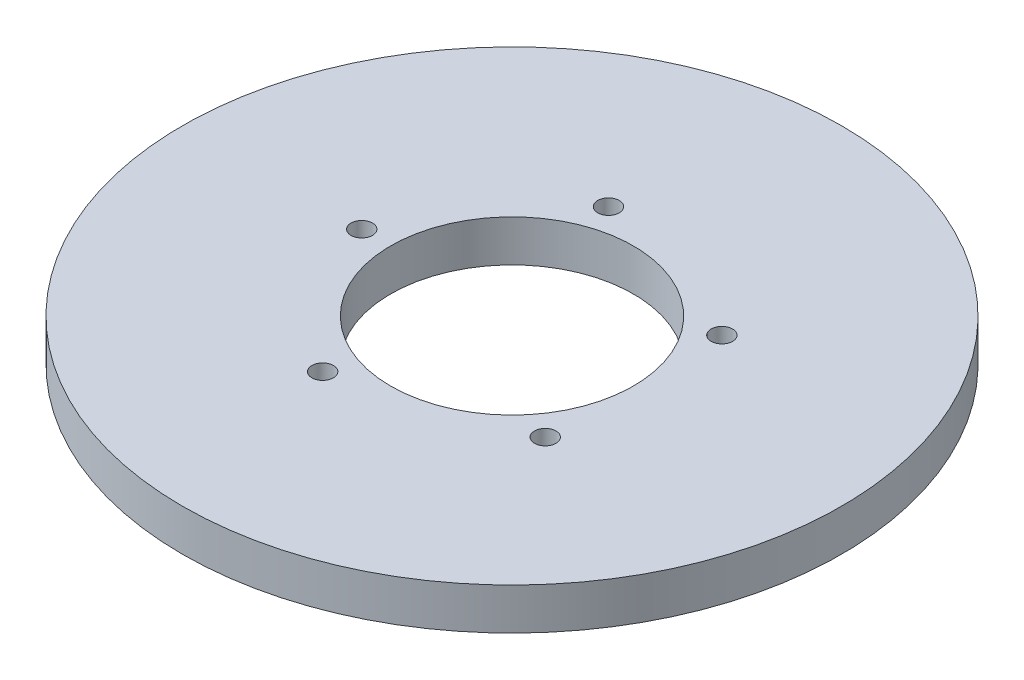
ISO-10303-21;
HEADER;
FILE_DESCRIPTION(('STEP AP214'),'2;1');
FILE_NAME('part.step','',(''),(''),'','','');
FILE_SCHEMA(('AUTOMOTIVE_DESIGN { 1 0 10303 214 1 1 1 1 }'));
ENDSEC;
DATA;
#1=APPLICATION_CONTEXT('core data for automotive mechanical design processes');
#2=APPLICATION_PROTOCOL_DEFINITION('international standard','automotive_design',2000,#1);
#3=PRODUCT_CONTEXT('',#1,'mechanical');
#4=PRODUCT('Part','Part','',(#3));
#5=PRODUCT_RELATED_PRODUCT_CATEGORY('part','',(#4));
#6=PRODUCT_DEFINITION_FORMATION('','',#4);
#7=PRODUCT_DEFINITION_CONTEXT('part definition',#1,'design');
#8=PRODUCT_DEFINITION('design','',#6,#7);
#9=PRODUCT_DEFINITION_SHAPE('','',#8);
#10=(LENGTH_UNIT() NAMED_UNIT(*) SI_UNIT(.MILLI.,.METRE.));
#11=(NAMED_UNIT(*) PLANE_ANGLE_UNIT() SI_UNIT($,.RADIAN.));
#12=(NAMED_UNIT(*) SI_UNIT($,.STERADIAN.) SOLID_ANGLE_UNIT());
#13=UNCERTAINTY_MEASURE_WITH_UNIT(LENGTH_MEASURE(1.E-05),#10,'distance_accuracy_value','');
#14=(GEOMETRIC_REPRESENTATION_CONTEXT(3) GLOBAL_UNCERTAINTY_ASSIGNED_CONTEXT((#13)) GLOBAL_UNIT_ASSIGNED_CONTEXT((#10,
#11,#12)) REPRESENTATION_CONTEXT('',''));
#15=CARTESIAN_POINT('',(0.,0.,0.));
#16=DIRECTION('',(0.,0.,1.));
#17=DIRECTION('',(1.,0.,0.));
#18=AXIS2_PLACEMENT_3D('',#15,#16,#17);
#19=CARTESIAN_POINT('',(0.,12.,0.));
#20=DIRECTION('',(0.,-1.,0.));
#21=DIRECTION('',(0.,0.,-1.));
#22=AXIS2_PLACEMENT_3D('',#19,#20,#21);
#23=CYLINDRICAL_SURFACE('',#22,95.);
#24=CARTESIAN_POINT('',(0.,12.,0.));
#25=DIRECTION('',(0.,1.,0.));
#26=DIRECTION('',(0.,0.,1.));
#27=AXIS2_PLACEMENT_3D('',#24,#25,#26);
#28=CIRCLE('',#27,95.);
#29=CARTESIAN_POINT('',(0.,12.,95.));
#30=VERTEX_POINT('',#29);
#31=EDGE_CURVE('E10',#30,#30,#28,.T.);
#32=ORIENTED_EDGE('',*,*,#31,.F.);
#33=EDGE_LOOP('',(#32));
#34=FACE_BOUND('',#33,.T.);
#35=CARTESIAN_POINT('',(0.,0.,0.));
#36=DIRECTION('',(0.,1.,0.));
#37=DIRECTION('',(0.,0.,1.));
#38=AXIS2_PLACEMENT_3D('',#35,#36,#37);
#39=CIRCLE('',#38,95.);
#40=CARTESIAN_POINT('',(0.,0.,95.));
#41=VERTEX_POINT('',#40);
#42=EDGE_CURVE('E37',#41,#41,#39,.T.);
#43=ORIENTED_EDGE('',*,*,#42,.T.);
#44=EDGE_LOOP('',(#43));
#45=FACE_BOUND('',#44,.T.);
#46=ADVANCED_FACE('F40',(#34,#45),#23,.T.);
#47=CARTESIAN_POINT('',(0.,12.,0.));
#48=DIRECTION('',(0.,1.,0.));
#49=DIRECTION('',(0.,0.,1.));
#50=AXIS2_PLACEMENT_3D('',#47,#48,#49);
#51=PLANE('',#50);
#52=CARTESIAN_POINT('',(-13.384494621116,12.,41.19323874882));
#53=DIRECTION('',(0.,1.,0.));
#54=DIRECTION('',(0.951056516295155,0.,0.309016994374945));
#55=AXIS2_PLACEMENT_3D('',#52,#53,#54);
#56=CIRCLE('',#55,3.09802362518894);
#57=CARTESIAN_POINT('',(-10.4380990647438,12.,42.1505806979784));
#58=VERTEX_POINT('',#57);
#59=EDGE_CURVE('E78',#58,#58,#56,.T.);
#60=ORIENTED_EDGE('',*,*,#59,.F.);
#61=EDGE_LOOP('',(#60));
#62=FACE_BOUND('',#61,.T.);
#63=CARTESIAN_POINT('',(35.0410618403224,12.,25.4588216534597));
#64=DIRECTION('',(0.,1.,0.));
#65=DIRECTION('',(0.587785252292469,0.,-0.809016994374951));
#66=AXIS2_PLACEMENT_3D('',#63,#64,#65);
#67=CIRCLE('',#66,3.09802362518894);
#68=CARTESIAN_POINT('',(36.8620344384621,12.,22.9524678917068));
#69=VERTEX_POINT('',#68);
#70=EDGE_CURVE('E71',#69,#69,#67,.T.);
#71=ORIENTED_EDGE('',*,*,#70,.F.);
#72=EDGE_LOOP('',(#71));
#73=FACE_BOUND('',#72,.T.);
#74=CARTESIAN_POINT('',(35.041061840322,12.,-25.4588216534602));
#75=DIRECTION('',(0.,1.,0.));
#76=DIRECTION('',(-0.58778525229248,0.,-0.809016994374942));
#77=AXIS2_PLACEMENT_3D('',#74,#75,#76);
#78=CIRCLE('',#77,3.09802362518894);
#79=CARTESIAN_POINT('',(33.2200892421823,12.,-27.9651754152131));
#80=VERTEX_POINT('',#79);
#81=EDGE_CURVE('E70',#80,#80,#78,.T.);
#82=ORIENTED_EDGE('',*,*,#81,.F.);
#83=EDGE_LOOP('',(#82));
#84=FACE_BOUND('',#83,.T.);
#85=CARTESIAN_POINT('',(-13.3844946211166,12.,-41.1932387488198));
#86=DIRECTION('',(0.,1.,0.));
#87=DIRECTION('',(-0.95105651629515,0.,0.309016994374958));
#88=AXIS2_PLACEMENT_3D('',#85,#86,#87);
#89=CIRCLE('',#88,3.09802362518894);
#90=CARTESIAN_POINT('',(-16.3308901774889,12.,-40.2358967996613));
#91=VERTEX_POINT('',#90);
#92=EDGE_CURVE('E61',#91,#91,#89,.T.);
#93=ORIENTED_EDGE('',*,*,#92,.F.);
#94=EDGE_LOOP('',(#93));
#95=FACE_BOUND('',#94,.T.);
#96=CARTESIAN_POINT('',(-43.3131344384122,12.,0.));
#97=DIRECTION('',(0.,1.,0.));
#98=DIRECTION('',(0.,0.,1.));
#99=AXIS2_PLACEMENT_3D('',#96,#97,#98);
#100=CIRCLE('',#99,3.09802362518894);
#101=CARTESIAN_POINT('',(-43.3131344384122,12.,3.09802362518894));
#102=VERTEX_POINT('',#101);
#103=EDGE_CURVE('E54',#102,#102,#100,.T.);
#104=ORIENTED_EDGE('',*,*,#103,.F.);
#105=EDGE_LOOP('',(#104));
#106=FACE_BOUND('',#105,.T.);
#107=CARTESIAN_POINT('',(0.,12.,0.));
#108=DIRECTION('',(0.,1.,0.));
#109=DIRECTION('',(0.,0.,1.));
#110=AXIS2_PLACEMENT_3D('',#107,#108,#109);
#111=CIRCLE('',#110,35.);
#112=CARTESIAN_POINT('',(0.,12.,35.));
#113=VERTEX_POINT('',#112);
#114=EDGE_CURVE('E50',#113,#113,#111,.T.);
#115=ORIENTED_EDGE('',*,*,#114,.F.);
#116=EDGE_LOOP('',(#115));
#117=FACE_BOUND('',#116,.T.);
#118=ORIENTED_EDGE('',*,*,#31,.T.);
#119=EDGE_LOOP('',(#118));
#120=FACE_BOUND('',#119,.T.);
#121=ADVANCED_FACE('F94',(#62,#73,#84,#95,#106,#117,#120),#51,.T.);
#122=CARTESIAN_POINT('',(0.,0.,0.));
#123=DIRECTION('',(0.,1.,0.));
#124=DIRECTION('',(0.,0.,1.));
#125=AXIS2_PLACEMENT_3D('',#122,#123,#124);
#126=PLANE('',#125);
#127=CARTESIAN_POINT('',(0.,0.,0.));
#128=DIRECTION('',(0.,1.,0.));
#129=DIRECTION('',(0.,0.,1.));
#130=AXIS2_PLACEMENT_3D('',#127,#128,#129);
#131=CIRCLE('',#130,35.);
#132=CARTESIAN_POINT('',(0.,0.,35.));
#133=VERTEX_POINT('',#132);
#134=EDGE_CURVE('E47',#133,#133,#131,.T.);
#135=ORIENTED_EDGE('',*,*,#134,.T.);
#136=EDGE_LOOP('',(#135));
#137=FACE_BOUND('',#136,.T.);
#138=ORIENTED_EDGE('',*,*,#42,.F.);
#139=EDGE_LOOP('',(#138));
#140=FACE_BOUND('',#139,.T.);
#141=ADVANCED_FACE('F100',(#137,#140),#126,.F.);
#142=CARTESIAN_POINT('',(0.,12.,0.));
#143=DIRECTION('',(0.,-1.,0.));
#144=DIRECTION('',(0.,0.,-1.));
#145=AXIS2_PLACEMENT_3D('',#142,#143,#144);
#146=CYLINDRICAL_SURFACE('',#145,35.);
#147=ORIENTED_EDGE('',*,*,#114,.T.);
#148=EDGE_LOOP('',(#147));
#149=FACE_BOUND('',#148,.T.);
#150=ORIENTED_EDGE('',*,*,#134,.F.);
#151=EDGE_LOOP('',(#150));
#152=FACE_BOUND('',#151,.T.);
#153=ADVANCED_FACE('F108',(#149,#152),#146,.F.);
#154=CARTESIAN_POINT('',(-43.3131344384122,0.228255470634649,0.));
#155=DIRECTION('',(0.,1.,0.));
#156=DIRECTION('',(0.,0.,1.));
#157=AXIS2_PLACEMENT_3D('',#154,#155,#156);
#158=CYLINDRICAL_SURFACE('',#157,3.09802362518894);
#159=CARTESIAN_POINT('',(-43.3131344384122,0.228255470634649,0.));
#160=DIRECTION('',(0.,1.,0.));
#161=DIRECTION('',(0.,0.,1.));
#162=AXIS2_PLACEMENT_3D('',#159,#160,#161);
#163=CIRCLE('',#162,3.09802362518894);
#164=CARTESIAN_POINT('',(-43.3131344384122,0.228255470634649,3.09802362518894));
#165=VERTEX_POINT('',#164);
#166=EDGE_CURVE('E55',#165,#165,#163,.T.);
#167=ORIENTED_EDGE('',*,*,#166,.F.);
#168=EDGE_LOOP('',(#167));
#169=FACE_BOUND('',#168,.T.);
#170=ORIENTED_EDGE('',*,*,#103,.T.);
#171=EDGE_LOOP('',(#170));
#172=FACE_BOUND('',#171,.T.);
#173=ADVANCED_FACE('F115',(#169,#172),#158,.F.);
#174=CARTESIAN_POINT('',(-43.3131344384122,0.228255470634649,0.));
#175=DIRECTION('',(0.,1.,0.));
#176=DIRECTION('',(0.,0.,1.));
#177=AXIS2_PLACEMENT_3D('',#174,#175,#176);
#178=PLANE('',#177);
#179=ORIENTED_EDGE('',*,*,#166,.T.);
#180=EDGE_LOOP('',(#179));
#181=FACE_BOUND('',#180,.T.);
#182=ADVANCED_FACE('F142',(#181),#178,.T.);
#183=CARTESIAN_POINT('',(-13.3844946211166,0.228255470634649,-41.1932387488198));
#184=DIRECTION('',(0.,1.,0.));
#185=DIRECTION('',(0.,0.,1.));
#186=AXIS2_PLACEMENT_3D('',#183,#184,#185);
#187=CYLINDRICAL_SURFACE('',#186,3.09802362518894);
#188=CARTESIAN_POINT('',(-13.3844946211166,0.228255470634649,-41.1932387488198));
#189=DIRECTION('',(0.,1.,0.));
#190=DIRECTION('',(-0.95105651629515,0.,0.309016994374958));
#191=AXIS2_PLACEMENT_3D('',#188,#189,#190);
#192=CIRCLE('',#191,3.09802362518894);
#193=CARTESIAN_POINT('',(-16.3308901774889,0.228255470634649,-40.2358967996613));
#194=VERTEX_POINT('',#193);
#195=EDGE_CURVE('E63',#194,#194,#192,.T.);
#196=ORIENTED_EDGE('',*,*,#195,.F.);
#197=EDGE_LOOP('',(#196));
#198=FACE_BOUND('',#197,.T.);
#199=ORIENTED_EDGE('',*,*,#92,.T.);
#200=EDGE_LOOP('',(#199));
#201=FACE_BOUND('',#200,.T.);
#202=ADVANCED_FACE('F147',(#198,#201),#187,.F.);
#203=CARTESIAN_POINT('',(-13.3844946211166,0.228255470634649,-41.1932387488198));
#204=DIRECTION('',(0.,1.,0.));
#205=DIRECTION('',(-0.95105651629515,0.,0.309016994374958));
#206=AXIS2_PLACEMENT_3D('',#203,#204,#205);
#207=PLANE('',#206);
#208=ORIENTED_EDGE('',*,*,#195,.T.);
#209=EDGE_LOOP('',(#208));
#210=FACE_BOUND('',#209,.T.);
#211=ADVANCED_FACE('F163',(#210),#207,.T.);
#212=CARTESIAN_POINT('',(35.041061840322,0.228255470634649,-25.4588216534602));
#213=DIRECTION('',(0.,1.,0.));
#214=DIRECTION('',(0.,0.,1.));
#215=AXIS2_PLACEMENT_3D('',#212,#213,#214);
#216=CYLINDRICAL_SURFACE('',#215,3.09802362518894);
#217=CARTESIAN_POINT('',(35.041061840322,0.228255470634649,-25.4588216534602));
#218=DIRECTION('',(0.,1.,0.));
#219=DIRECTION('',(-0.58778525229248,0.,-0.809016994374942));
#220=AXIS2_PLACEMENT_3D('',#217,#218,#219);
#221=CIRCLE('',#220,3.09802362518894);
#222=CARTESIAN_POINT('',(33.2200892421823,0.228255470634649,-27.9651754152131));
#223=VERTEX_POINT('',#222);
#224=EDGE_CURVE('E69',#223,#223,#221,.T.);
#225=ORIENTED_EDGE('',*,*,#224,.F.);
#226=EDGE_LOOP('',(#225));
#227=FACE_BOUND('',#226,.T.);
#228=ORIENTED_EDGE('',*,*,#81,.T.);
#229=EDGE_LOOP('',(#228));
#230=FACE_BOUND('',#229,.T.);
#231=ADVANCED_FACE('F172',(#227,#230),#216,.F.);
#232=CARTESIAN_POINT('',(35.041061840322,0.228255470634649,-25.4588216534602));
#233=DIRECTION('',(0.,1.,0.));
#234=DIRECTION('',(-0.58778525229248,0.,-0.809016994374942));
#235=AXIS2_PLACEMENT_3D('',#232,#233,#234);
#236=PLANE('',#235);
#237=ORIENTED_EDGE('',*,*,#224,.T.);
#238=EDGE_LOOP('',(#237));
#239=FACE_BOUND('',#238,.T.);
#240=ADVANCED_FACE('F185',(#239),#236,.T.);
#241=CARTESIAN_POINT('',(35.0410618403224,0.228255470634649,25.4588216534597));
#242=DIRECTION('',(0.,1.,0.));
#243=DIRECTION('',(0.,0.,1.));
#244=AXIS2_PLACEMENT_3D('',#241,#242,#243);
#245=CYLINDRICAL_SURFACE('',#244,3.09802362518894);
#246=CARTESIAN_POINT('',(35.0410618403224,0.228255470634649,25.4588216534597));
#247=DIRECTION('',(0.,1.,0.));
#248=DIRECTION('',(0.587785252292469,0.,-0.809016994374951));
#249=AXIS2_PLACEMENT_3D('',#246,#247,#248);
#250=CIRCLE('',#249,3.09802362518894);
#251=CARTESIAN_POINT('',(36.8620344384621,0.228255470634649,22.9524678917068));
#252=VERTEX_POINT('',#251);
#253=EDGE_CURVE('E76',#252,#252,#250,.T.);
#254=ORIENTED_EDGE('',*,*,#253,.F.);
#255=EDGE_LOOP('',(#254));
#256=FACE_BOUND('',#255,.T.);
#257=ORIENTED_EDGE('',*,*,#70,.T.);
#258=EDGE_LOOP('',(#257));
#259=FACE_BOUND('',#258,.T.);
#260=ADVANCED_FACE('F191',(#256,#259),#245,.F.);
#261=CARTESIAN_POINT('',(35.0410618403224,0.228255470634649,25.4588216534597));
#262=DIRECTION('',(0.,1.,0.));
#263=DIRECTION('',(0.587785252292469,0.,-0.809016994374951));
#264=AXIS2_PLACEMENT_3D('',#261,#262,#263);
#265=PLANE('',#264);
#266=ORIENTED_EDGE('',*,*,#253,.T.);
#267=EDGE_LOOP('',(#266));
#268=FACE_BOUND('',#267,.T.);
#269=ADVANCED_FACE('F89',(#268),#265,.T.);
#270=CARTESIAN_POINT('',(-13.384494621116,0.228255470634649,41.19323874882));
#271=DIRECTION('',(0.,1.,0.));
#272=DIRECTION('',(0.,0.,1.));
#273=AXIS2_PLACEMENT_3D('',#270,#271,#272);
#274=CYLINDRICAL_SURFACE('',#273,3.09802362518894);
#275=CARTESIAN_POINT('',(-13.384494621116,0.228255470634649,41.19323874882));
#276=DIRECTION('',(0.,1.,0.));
#277=DIRECTION('',(0.951056516295155,0.,0.309016994374945));
#278=AXIS2_PLACEMENT_3D('',#275,#276,#277);
#279=CIRCLE('',#278,3.09802362518894);
#280=CARTESIAN_POINT('',(-10.4380990647438,0.228255470634649,42.1505806979784));
#281=VERTEX_POINT('',#280);
#282=EDGE_CURVE('E59',#281,#281,#279,.T.);
#283=ORIENTED_EDGE('',*,*,#282,.F.);
#284=EDGE_LOOP('',(#283));
#285=FACE_BOUND('',#284,.T.);
#286=ORIENTED_EDGE('',*,*,#59,.T.);
#287=EDGE_LOOP('',(#286));
#288=FACE_BOUND('',#287,.T.);
#289=ADVANCED_FACE('F87',(#285,#288),#274,.F.);
#290=CARTESIAN_POINT('',(-13.384494621116,0.228255470634649,41.19323874882));
#291=DIRECTION('',(0.,1.,0.));
#292=DIRECTION('',(0.951056516295155,0.,0.309016994374945));
#293=AXIS2_PLACEMENT_3D('',#290,#291,#292);
#294=PLANE('',#293);
#295=ORIENTED_EDGE('',*,*,#282,.T.);
#296=EDGE_LOOP('',(#295));
#297=FACE_BOUND('',#296,.T.);
#298=ADVANCED_FACE('F84',(#297),#294,.T.);
#299=CLOSED_SHELL('',(#46,#121,#141,#153,#173,#182,#202,#211,#231,#240,#260,#269,#289,#298));
#300=MANIFOLD_SOLID_BREP('B2',#299);
#301=ADVANCED_BREP_SHAPE_REPRESENTATION('',(#18,#300),#14);
#302=SHAPE_DEFINITION_REPRESENTATION(#9,#301);
ENDSEC;
END-ISO-10303-21;
